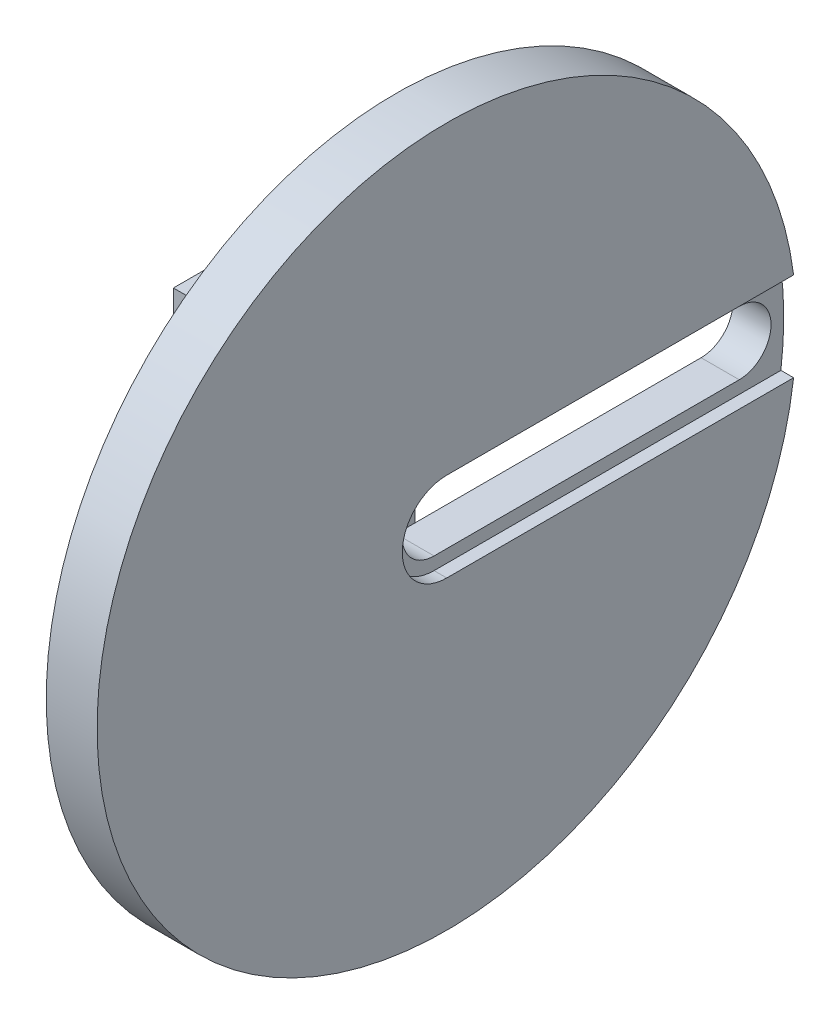
ISO-10303-21;
HEADER;
FILE_DESCRIPTION(('STEP AP214'),'2;1');
FILE_NAME('part.step','',(''),(''),'','','');
FILE_SCHEMA(('AUTOMOTIVE_DESIGN { 1 0 10303 214 1 1 1 1 }'));
ENDSEC;
DATA;
#1=APPLICATION_CONTEXT('core data for automotive mechanical design processes');
#2=APPLICATION_PROTOCOL_DEFINITION('international standard','automotive_design',2000,#1);
#3=PRODUCT_CONTEXT('',#1,'mechanical');
#4=PRODUCT('Part','Part','',(#3));
#5=PRODUCT_RELATED_PRODUCT_CATEGORY('part','',(#4));
#6=PRODUCT_DEFINITION_FORMATION('','',#4);
#7=PRODUCT_DEFINITION_CONTEXT('part definition',#1,'design');
#8=PRODUCT_DEFINITION('design','',#6,#7);
#9=PRODUCT_DEFINITION_SHAPE('','',#8);
#10=(LENGTH_UNIT() NAMED_UNIT(*) SI_UNIT(.MILLI.,.METRE.));
#11=(NAMED_UNIT(*) PLANE_ANGLE_UNIT() SI_UNIT($,.RADIAN.));
#12=(NAMED_UNIT(*) SI_UNIT($,.STERADIAN.) SOLID_ANGLE_UNIT());
#13=UNCERTAINTY_MEASURE_WITH_UNIT(LENGTH_MEASURE(1.E-05),#10,'distance_accuracy_value','');
#14=(GEOMETRIC_REPRESENTATION_CONTEXT(3) GLOBAL_UNCERTAINTY_ASSIGNED_CONTEXT((#13)) GLOBAL_UNIT_ASSIGNED_CONTEXT((#10,
#11,#12)) REPRESENTATION_CONTEXT('',''));
#15=CARTESIAN_POINT('',(0.,0.,0.));
#16=DIRECTION('',(0.,0.,1.));
#17=DIRECTION('',(1.,0.,0.));
#18=AXIS2_PLACEMENT_3D('',#15,#16,#17);
#19=CARTESIAN_POINT('',(-0.001000000000001,0.,0.));
#20=DIRECTION('',(1.,0.,0.));
#21=DIRECTION('',(0.,0.,-1.));
#22=AXIS2_PLACEMENT_3D('',#19,#20,#21);
#23=CYLINDRICAL_SURFACE('',#22,5.);
#24=CARTESIAN_POINT('',(36.,0.,0.));
#25=DIRECTION('',(1.,0.,0.));
#26=DIRECTION('',(0.,0.,-1.));
#27=AXIS2_PLACEMENT_3D('',#24,#25,#26);
#28=CIRCLE('',#27,5.);
#29=CARTESIAN_POINT('',(36.,-5.,0.));
#30=VERTEX_POINT('',#29);
#31=CARTESIAN_POINT('',(36.,5.,0.));
#32=VERTEX_POINT('',#31);
#33=EDGE_CURVE('E187',#30,#32,#28,.F.);
#34=ORIENTED_EDGE('',*,*,#33,.F.);
#35=DIRECTION('',(1.,0.,0.));
#36=VECTOR('',#35,1.);
#37=CARTESIAN_POINT('',(-0.001000000000001,-5.,0.));
#38=LINE('',#37,#36);
#39=CARTESIAN_POINT('',(30.,-5.,0.));
#40=VERTEX_POINT('',#39);
#41=EDGE_CURVE('E197',#40,#30,#38,.T.);
#42=ORIENTED_EDGE('',*,*,#41,.F.);
#43=CARTESIAN_POINT('',(30.,0.,0.));
#44=DIRECTION('',(1.,0.,0.));
#45=DIRECTION('',(0.,0.,-1.));
#46=AXIS2_PLACEMENT_3D('',#43,#44,#45);
#47=CIRCLE('',#46,5.);
#48=CARTESIAN_POINT('',(30.,5.,0.));
#49=VERTEX_POINT('',#48);
#50=EDGE_CURVE('E194',#40,#49,#47,.F.);
#51=ORIENTED_EDGE('',*,*,#50,.T.);
#52=DIRECTION('',(1.,0.,0.));
#53=VECTOR('',#52,1.);
#54=CARTESIAN_POINT('',(-0.001000000000001,5.,0.));
#55=LINE('',#54,#53);
#56=EDGE_CURVE('E198',#49,#32,#55,.T.);
#57=ORIENTED_EDGE('',*,*,#56,.T.);
#58=EDGE_LOOP('',(#34,#42,#51,#57));
#59=FACE_BOUND('',#58,.T.);
#60=ADVANCED_FACE('F33',(#59),#23,.F.);
#61=CARTESIAN_POINT('',(-0.001000000000001,5.,0.));
#62=DIRECTION('',(0.,-1.,0.));
#63=DIRECTION('',(0.,0.,-1.));
#64=AXIS2_PLACEMENT_3D('',#61,#62,#63);
#65=PLANE('',#64);
#66=DIRECTION('',(1.,0.,0.));
#67=VECTOR('',#66,1.);
#68=CARTESIAN_POINT('',(-0.001000000000001,5.,-48.));
#69=LINE('',#68,#67);
#70=CARTESIAN_POINT('',(30.,5.,-48.));
#71=VERTEX_POINT('',#70);
#72=CARTESIAN_POINT('',(36.,5.,-48.));
#73=VERTEX_POINT('',#72);
#74=EDGE_CURVE('E202',#71,#73,#69,.T.);
#75=ORIENTED_EDGE('',*,*,#74,.T.);
#76=DIRECTION('',(0.,0.,1.));
#77=VECTOR('',#76,1.);
#78=CARTESIAN_POINT('',(36.,5.,0.));
#79=LINE('',#78,#77);
#80=EDGE_CURVE('E184',#73,#32,#79,.T.);
#81=ORIENTED_EDGE('',*,*,#80,.T.);
#82=ORIENTED_EDGE('',*,*,#56,.F.);
#83=DIRECTION('',(0.,0.,1.));
#84=VECTOR('',#83,1.);
#85=CARTESIAN_POINT('',(30.,5.,0.));
#86=LINE('',#85,#84);
#87=EDGE_CURVE('E191',#71,#49,#86,.T.);
#88=ORIENTED_EDGE('',*,*,#87,.F.);
#89=EDGE_LOOP('',(#75,#81,#82,#88));
#90=FACE_BOUND('',#89,.T.);
#91=ADVANCED_FACE('F338',(#90),#65,.T.);
#92=CARTESIAN_POINT('',(-0.001000000000001,0.,-48.));
#93=DIRECTION('',(1.,0.,0.));
#94=DIRECTION('',(0.,0.,-1.));
#95=AXIS2_PLACEMENT_3D('',#92,#93,#94);
#96=CYLINDRICAL_SURFACE('',#95,5.);
#97=CARTESIAN_POINT('',(36.,0.,-48.));
#98=DIRECTION('',(1.,0.,0.));
#99=DIRECTION('',(0.,0.,-1.));
#100=AXIS2_PLACEMENT_3D('',#97,#98,#99);
#101=CIRCLE('',#100,5.);
#102=CARTESIAN_POINT('',(36.,-5.,-48.));
#103=VERTEX_POINT('',#102);
#104=EDGE_CURVE('E55',#73,#103,#101,.F.);
#105=ORIENTED_EDGE('',*,*,#104,.F.);
#106=ORIENTED_EDGE('',*,*,#74,.F.);
#107=CARTESIAN_POINT('',(30.,0.,-48.));
#108=DIRECTION('',(1.,0.,0.));
#109=DIRECTION('',(0.,0.,-1.));
#110=AXIS2_PLACEMENT_3D('',#107,#108,#109);
#111=CIRCLE('',#110,5.);
#112=CARTESIAN_POINT('',(30.,-5.,-48.));
#113=VERTEX_POINT('',#112);
#114=EDGE_CURVE('E189',#71,#113,#111,.F.);
#115=ORIENTED_EDGE('',*,*,#114,.T.);
#116=DIRECTION('',(1.,0.,0.));
#117=VECTOR('',#116,1.);
#118=CARTESIAN_POINT('',(-0.001000000000001,-5.,-48.));
#119=LINE('',#118,#117);
#120=EDGE_CURVE('E205',#113,#103,#119,.T.);
#121=ORIENTED_EDGE('',*,*,#120,.T.);
#122=EDGE_LOOP('',(#105,#106,#115,#121));
#123=FACE_BOUND('',#122,.T.);
#124=ADVANCED_FACE('F344',(#123),#96,.F.);
#125=CARTESIAN_POINT('',(-0.001000000000001,-5.,0.));
#126=DIRECTION('',(0.,-1.,0.));
#127=DIRECTION('',(0.,0.,-1.));
#128=AXIS2_PLACEMENT_3D('',#125,#126,#127);
#129=PLANE('',#128);
#130=DIRECTION('',(0.,0.,1.));
#131=VECTOR('',#130,1.);
#132=CARTESIAN_POINT('',(36.,-5.,0.));
#133=LINE('',#132,#131);
#134=EDGE_CURVE('E11',#103,#30,#133,.T.);
#135=ORIENTED_EDGE('',*,*,#134,.F.);
#136=ORIENTED_EDGE('',*,*,#120,.F.);
#137=DIRECTION('',(0.,0.,1.));
#138=VECTOR('',#137,1.);
#139=CARTESIAN_POINT('',(30.,-5.,0.));
#140=LINE('',#139,#138);
#141=EDGE_CURVE('E201',#113,#40,#140,.T.);
#142=ORIENTED_EDGE('',*,*,#141,.T.);
#143=ORIENTED_EDGE('',*,*,#41,.T.);
#144=EDGE_LOOP('',(#135,#136,#142,#143));
#145=FACE_BOUND('',#144,.T.);
#146=ADVANCED_FACE('F349',(#145),#129,.F.);
#147=CARTESIAN_POINT('',(18.,0.,0.));
#148=DIRECTION('',(-1.,0.,0.));
#149=DIRECTION('',(0.,0.,1.));
#150=AXIS2_PLACEMENT_3D('',#147,#148,#149);
#151=PLANE('',#150);
#152=CARTESIAN_POINT('',(18.,0.,0.));
#153=DIRECTION('',(-1.,0.,0.));
#154=DIRECTION('',(0.,0.,1.));
#155=AXIS2_PLACEMENT_3D('',#152,#153,#154);
#156=CIRCLE('',#155,9.);
#157=CARTESIAN_POINT('',(18.,0.,9.));
#158=VERTEX_POINT('',#157);
#159=EDGE_CURVE('E176',#158,#158,#156,.F.);
#160=ORIENTED_EDGE('',*,*,#159,.F.);
#161=EDGE_LOOP('',(#160));
#162=FACE_BOUND('',#161,.T.);
#163=DIRECTION('',(0.,0.,1.));
#164=VECTOR('',#163,1.);
#165=CARTESIAN_POINT('',(18.,-18.,15.));
#166=LINE('',#165,#164);
#167=CARTESIAN_POINT('',(18.,-18.,-15.));
#168=VERTEX_POINT('',#167);
#169=CARTESIAN_POINT('',(18.,-18.,15.));
#170=VERTEX_POINT('',#169);
#171=EDGE_CURVE('E216',#168,#170,#166,.T.);
#172=ORIENTED_EDGE('',*,*,#171,.F.);
#173=DIRECTION('',(0.,1.,0.));
#174=VECTOR('',#173,1.);
#175=CARTESIAN_POINT('',(18.,-26.,-15.));
#176=LINE('',#175,#174);
#177=CARTESIAN_POINT('',(18.,18.,-15.));
#178=VERTEX_POINT('',#177);
#179=EDGE_CURVE('E272',#168,#178,#176,.T.);
#180=ORIENTED_EDGE('',*,*,#179,.T.);
#181=DIRECTION('',(0.,0.,-1.));
#182=VECTOR('',#181,1.);
#183=CARTESIAN_POINT('',(18.,18.,15.));
#184=LINE('',#183,#182);
#185=CARTESIAN_POINT('',(18.,18.,15.));
#186=VERTEX_POINT('',#185);
#187=EDGE_CURVE('E239',#186,#178,#184,.T.);
#188=ORIENTED_EDGE('',*,*,#187,.F.);
#189=DIRECTION('',(0.,-1.,0.));
#190=VECTOR('',#189,1.);
#191=CARTESIAN_POINT('',(18.,-26.,15.));
#192=LINE('',#191,#190);
#193=EDGE_CURVE('E261',#186,#170,#192,.T.);
#194=ORIENTED_EDGE('',*,*,#193,.T.);
#195=EDGE_LOOP('',(#172,#180,#188,#194));
#196=FACE_BOUND('',#195,.T.);
#197=ADVANCED_FACE('F318',(#162,#196),#151,.F.);
#198=CARTESIAN_POINT('',(10.,0.,0.));
#199=DIRECTION('',(-1.,0.,0.));
#200=DIRECTION('',(0.,0.,1.));
#201=AXIS2_PLACEMENT_3D('',#198,#199,#200);
#202=PLANE('',#201);
#203=CARTESIAN_POINT('',(10.,0.,0.));
#204=DIRECTION('',(-1.,0.,0.));
#205=DIRECTION('',(0.,0.,1.));
#206=AXIS2_PLACEMENT_3D('',#203,#204,#205);
#207=CIRCLE('',#206,9.);
#208=CARTESIAN_POINT('',(10.,0.,9.));
#209=VERTEX_POINT('',#208);
#210=EDGE_CURVE('E170',#209,#209,#207,.F.);
#211=ORIENTED_EDGE('',*,*,#210,.T.);
#212=EDGE_LOOP('',(#211));
#213=FACE_BOUND('',#212,.T.);
#214=DIRECTION('',(0.,1.,0.));
#215=VECTOR('',#214,1.);
#216=CARTESIAN_POINT('',(10.,-26.,-15.));
#217=LINE('',#216,#215);
#218=CARTESIAN_POINT('',(10.,-26.,-15.));
#219=VERTEX_POINT('',#218);
#220=CARTESIAN_POINT('',(10.,26.,-15.));
#221=VERTEX_POINT('',#220);
#222=EDGE_CURVE('E270',#219,#221,#217,.T.);
#223=ORIENTED_EDGE('',*,*,#222,.F.);
#224=DIRECTION('',(0.,0.,-1.));
#225=VECTOR('',#224,1.);
#226=CARTESIAN_POINT('',(10.,-26.,15.));
#227=LINE('',#226,#225);
#228=CARTESIAN_POINT('',(10.,-26.,15.));
#229=VERTEX_POINT('',#228);
#230=EDGE_CURVE('E273',#229,#219,#227,.T.);
#231=ORIENTED_EDGE('',*,*,#230,.F.);
#232=DIRECTION('',(0.,-1.,0.));
#233=VECTOR('',#232,1.);
#234=CARTESIAN_POINT('',(10.,-26.,15.));
#235=LINE('',#234,#233);
#236=CARTESIAN_POINT('',(10.,26.,15.));
#237=VERTEX_POINT('',#236);
#238=EDGE_CURVE('E277',#237,#229,#235,.T.);
#239=ORIENTED_EDGE('',*,*,#238,.F.);
#240=DIRECTION('',(0.,0.,1.));
#241=VECTOR('',#240,1.);
#242=CARTESIAN_POINT('',(10.,26.,15.));
#243=LINE('',#242,#241);
#244=EDGE_CURVE('E283',#221,#237,#243,.T.);
#245=ORIENTED_EDGE('',*,*,#244,.F.);
#246=EDGE_LOOP('',(#223,#231,#239,#245));
#247=FACE_BOUND('',#246,.T.);
#248=ADVANCED_FACE('F303',(#213,#247),#202,.T.);
#249=CARTESIAN_POINT('',(18.,-26.,-15.));
#250=DIRECTION('',(0.,0.,1.));
#251=DIRECTION('',(1.,0.,0.));
#252=AXIS2_PLACEMENT_3D('',#249,#250,#251);
#253=PLANE('',#252);
#254=ORIENTED_EDGE('',*,*,#222,.T.);
#255=DIRECTION('',(-1.,0.,0.));
#256=VECTOR('',#255,1.);
#257=CARTESIAN_POINT('',(18.,26.,-15.));
#258=LINE('',#257,#256);
#259=CARTESIAN_POINT('',(30.,26.,-15.));
#260=VERTEX_POINT('',#259);
#261=EDGE_CURVE('E41',#260,#221,#258,.T.);
#262=ORIENTED_EDGE('',*,*,#261,.F.);
#263=DIRECTION('',(0.,1.,0.));
#264=VECTOR('',#263,1.);
#265=CARTESIAN_POINT('',(30.,26.,-15.));
#266=LINE('',#265,#264);
#267=CARTESIAN_POINT('',(30.,18.,-15.));
#268=VERTEX_POINT('',#267);
#269=EDGE_CURVE('E246',#268,#260,#266,.T.);
#270=ORIENTED_EDGE('',*,*,#269,.F.);
#271=DIRECTION('',(-1.,0.,0.));
#272=VECTOR('',#271,1.);
#273=CARTESIAN_POINT('',(30.,18.,-15.));
#274=LINE('',#273,#272);
#275=EDGE_CURVE('E252',#268,#178,#274,.T.);
#276=ORIENTED_EDGE('',*,*,#275,.T.);
#277=ORIENTED_EDGE('',*,*,#179,.F.);
#278=DIRECTION('',(-1.,0.,0.));
#279=VECTOR('',#278,1.);
#280=CARTESIAN_POINT('',(30.,-18.,-15.));
#281=LINE('',#280,#279);
#282=CARTESIAN_POINT('',(30.,-18.,-15.));
#283=VERTEX_POINT('',#282);
#284=EDGE_CURVE('E236',#283,#168,#281,.T.);
#285=ORIENTED_EDGE('',*,*,#284,.F.);
#286=DIRECTION('',(0.,1.,0.));
#287=VECTOR('',#286,1.);
#288=CARTESIAN_POINT('',(30.,-26.,-15.));
#289=LINE('',#288,#287);
#290=CARTESIAN_POINT('',(30.,-26.,-15.));
#291=VERTEX_POINT('',#290);
#292=EDGE_CURVE('E225',#291,#283,#289,.T.);
#293=ORIENTED_EDGE('',*,*,#292,.F.);
#294=DIRECTION('',(-1.,0.,0.));
#295=VECTOR('',#294,1.);
#296=CARTESIAN_POINT('',(18.,-26.,-15.));
#297=LINE('',#296,#295);
#298=EDGE_CURVE('E276',#291,#219,#297,.T.);
#299=ORIENTED_EDGE('',*,*,#298,.T.);
#300=EDGE_LOOP('',(#254,#262,#270,#276,#277,#285,#293,#299));
#301=FACE_BOUND('',#300,.T.);
#302=ADVANCED_FACE('F35',(#301),#253,.F.);
#303=CARTESIAN_POINT('',(18.,26.,15.));
#304=DIRECTION('',(0.,-1.,0.));
#305=DIRECTION('',(0.,0.,-1.));
#306=AXIS2_PLACEMENT_3D('',#303,#304,#305);
#307=PLANE('',#306);
#308=ORIENTED_EDGE('',*,*,#244,.T.);
#309=DIRECTION('',(-1.,0.,0.));
#310=VECTOR('',#309,1.);
#311=CARTESIAN_POINT('',(18.,26.,15.));
#312=LINE('',#311,#310);
#313=CARTESIAN_POINT('',(30.,26.,15.));
#314=VERTEX_POINT('',#313);
#315=EDGE_CURVE('E290',#314,#237,#312,.T.);
#316=ORIENTED_EDGE('',*,*,#315,.F.);
#317=DIRECTION('',(0.,0.,1.));
#318=VECTOR('',#317,1.);
#319=CARTESIAN_POINT('',(30.,26.,15.));
#320=LINE('',#319,#318);
#321=EDGE_CURVE('E249',#260,#314,#320,.T.);
#322=ORIENTED_EDGE('',*,*,#321,.F.);
#323=ORIENTED_EDGE('',*,*,#261,.T.);
#324=EDGE_LOOP('',(#308,#316,#322,#323));
#325=FACE_BOUND('',#324,.T.);
#326=ADVANCED_FACE('F296',(#325),#307,.F.);
#327=CARTESIAN_POINT('',(18.,-26.,15.));
#328=DIRECTION('',(0.,0.,-1.));
#329=DIRECTION('',(-1.,0.,0.));
#330=AXIS2_PLACEMENT_3D('',#327,#328,#329);
#331=PLANE('',#330);
#332=ORIENTED_EDGE('',*,*,#238,.T.);
#333=DIRECTION('',(-1.,0.,0.));
#334=VECTOR('',#333,1.);
#335=CARTESIAN_POINT('',(18.,-26.,15.));
#336=LINE('',#335,#334);
#337=CARTESIAN_POINT('',(30.,-26.,15.));
#338=VERTEX_POINT('',#337);
#339=EDGE_CURVE('E288',#338,#229,#336,.T.);
#340=ORIENTED_EDGE('',*,*,#339,.F.);
#341=DIRECTION('',(0.,-1.,0.));
#342=VECTOR('',#341,1.);
#343=CARTESIAN_POINT('',(30.,-26.,15.));
#344=LINE('',#343,#342);
#345=CARTESIAN_POINT('',(30.,-18.,15.));
#346=VERTEX_POINT('',#345);
#347=EDGE_CURVE('E219',#346,#338,#344,.T.);
#348=ORIENTED_EDGE('',*,*,#347,.F.);
#349=DIRECTION('',(-1.,0.,0.));
#350=VECTOR('',#349,1.);
#351=CARTESIAN_POINT('',(30.,-18.,15.));
#352=LINE('',#351,#350);
#353=EDGE_CURVE('E231',#346,#170,#352,.T.);
#354=ORIENTED_EDGE('',*,*,#353,.T.);
#355=ORIENTED_EDGE('',*,*,#193,.F.);
#356=DIRECTION('',(-1.,0.,0.));
#357=VECTOR('',#356,1.);
#358=CARTESIAN_POINT('',(30.,18.,15.));
#359=LINE('',#358,#357);
#360=CARTESIAN_POINT('',(30.,18.,15.));
#361=VERTEX_POINT('',#360);
#362=EDGE_CURVE('E265',#361,#186,#359,.T.);
#363=ORIENTED_EDGE('',*,*,#362,.F.);
#364=DIRECTION('',(0.,-1.,0.));
#365=VECTOR('',#364,1.);
#366=CARTESIAN_POINT('',(30.,26.,15.));
#367=LINE('',#366,#365);
#368=EDGE_CURVE('E240',#314,#361,#367,.T.);
#369=ORIENTED_EDGE('',*,*,#368,.F.);
#370=ORIENTED_EDGE('',*,*,#315,.T.);
#371=EDGE_LOOP('',(#332,#340,#348,#354,#355,#363,#369,#370));
#372=FACE_BOUND('',#371,.T.);
#373=ADVANCED_FACE('F306',(#372),#331,.F.);
#374=CARTESIAN_POINT('',(18.,-26.,15.));
#375=DIRECTION('',(0.,1.,0.));
#376=DIRECTION('',(0.,0.,1.));
#377=AXIS2_PLACEMENT_3D('',#374,#375,#376);
#378=PLANE('',#377);
#379=ORIENTED_EDGE('',*,*,#230,.T.);
#380=ORIENTED_EDGE('',*,*,#298,.F.);
#381=DIRECTION('',(0.,0.,-1.));
#382=VECTOR('',#381,1.);
#383=CARTESIAN_POINT('',(30.,-26.,15.));
#384=LINE('',#383,#382);
#385=EDGE_CURVE('E222',#338,#291,#384,.T.);
#386=ORIENTED_EDGE('',*,*,#385,.F.);
#387=ORIENTED_EDGE('',*,*,#339,.T.);
#388=EDGE_LOOP('',(#379,#380,#386,#387));
#389=FACE_BOUND('',#388,.T.);
#390=ADVANCED_FACE('F309',(#389),#378,.F.);
#391=CARTESIAN_POINT('',(30.,18.,15.));
#392=DIRECTION('',(0.,1.,0.));
#393=DIRECTION('',(0.,0.,1.));
#394=AXIS2_PLACEMENT_3D('',#391,#392,#393);
#395=PLANE('',#394);
#396=ORIENTED_EDGE('',*,*,#187,.T.);
#397=ORIENTED_EDGE('',*,*,#275,.F.);
#398=DIRECTION('',(0.,0.,-1.));
#399=VECTOR('',#398,1.);
#400=CARTESIAN_POINT('',(30.,18.,15.));
#401=LINE('',#400,#399);
#402=EDGE_CURVE('E243',#361,#268,#401,.T.);
#403=ORIENTED_EDGE('',*,*,#402,.F.);
#404=ORIENTED_EDGE('',*,*,#362,.T.);
#405=EDGE_LOOP('',(#396,#397,#403,#404));
#406=FACE_BOUND('',#405,.T.);
#407=ADVANCED_FACE('F321',(#406),#395,.F.);
#408=CARTESIAN_POINT('',(30.,-18.,15.));
#409=DIRECTION('',(0.,-1.,0.));
#410=DIRECTION('',(0.,0.,-1.));
#411=AXIS2_PLACEMENT_3D('',#408,#409,#410);
#412=PLANE('',#411);
#413=ORIENTED_EDGE('',*,*,#171,.T.);
#414=ORIENTED_EDGE('',*,*,#353,.F.);
#415=DIRECTION('',(0.,0.,1.));
#416=VECTOR('',#415,1.);
#417=CARTESIAN_POINT('',(30.,-18.,15.));
#418=LINE('',#417,#416);
#419=EDGE_CURVE('E228',#283,#346,#418,.T.);
#420=ORIENTED_EDGE('',*,*,#419,.F.);
#421=ORIENTED_EDGE('',*,*,#284,.T.);
#422=EDGE_LOOP('',(#413,#414,#420,#421));
#423=FACE_BOUND('',#422,.T.);
#424=ADVANCED_FACE('F317',(#423),#412,.F.);
#425=CARTESIAN_POINT('',(30.,0.,0.));
#426=DIRECTION('',(1.,0.,0.));
#427=DIRECTION('',(0.,0.,-1.));
#428=AXIS2_PLACEMENT_3D('',#425,#426,#427);
#429=PLANE('',#428);
#430=ORIENTED_EDGE('',*,*,#87,.T.);
#431=ORIENTED_EDGE('',*,*,#50,.F.);
#432=ORIENTED_EDGE('',*,*,#141,.F.);
#433=ORIENTED_EDGE('',*,*,#114,.F.);
#434=EDGE_LOOP('',(#430,#431,#432,#433));
#435=FACE_BOUND('',#434,.T.);
#436=ORIENTED_EDGE('',*,*,#347,.T.);
#437=ORIENTED_EDGE('',*,*,#385,.T.);
#438=ORIENTED_EDGE('',*,*,#292,.T.);
#439=ORIENTED_EDGE('',*,*,#419,.T.);
#440=EDGE_LOOP('',(#436,#437,#438,#439));
#441=FACE_BOUND('',#440,.T.);
#442=CARTESIAN_POINT('',(30.,0.,0.));
#443=DIRECTION('',(1.,0.,0.));
#444=DIRECTION('',(0.,0.,-1.));
#445=AXIS2_PLACEMENT_3D('',#442,#443,#444);
#446=CIRCLE('',#445,55.);
#447=CARTESIAN_POINT('',(30.,0.,-55.));
#448=VERTEX_POINT('',#447);
#449=EDGE_CURVE('E212',#448,#448,#446,.T.);
#450=ORIENTED_EDGE('',*,*,#449,.F.);
#451=EDGE_LOOP('',(#450));
#452=FACE_BOUND('',#451,.T.);
#453=ORIENTED_EDGE('',*,*,#402,.T.);
#454=ORIENTED_EDGE('',*,*,#269,.T.);
#455=ORIENTED_EDGE('',*,*,#321,.T.);
#456=ORIENTED_EDGE('',*,*,#368,.T.);
#457=EDGE_LOOP('',(#453,#454,#455,#456));
#458=FACE_BOUND('',#457,.T.);
#459=ADVANCED_FACE('F311',(#435,#441,#452,#458),#429,.F.);
#460=CARTESIAN_POINT('',(38.,0.,0.));
#461=DIRECTION('',(-1.,0.,0.));
#462=DIRECTION('',(0.,0.,1.));
#463=AXIS2_PLACEMENT_3D('',#460,#461,#462);
#464=CYLINDRICAL_SURFACE('',#463,55.);
#465=CARTESIAN_POINT('',(38.,0.,0.));
#466=DIRECTION('',(1.,0.,0.));
#467=DIRECTION('',(0.,0.,-1.));
#468=AXIS2_PLACEMENT_3D('',#465,#466,#467);
#469=CIRCLE('',#468,55.);
#470=CARTESIAN_POINT('',(38.,6.99999999999998,-54.5527267879434));
#471=VERTEX_POINT('',#470);
#472=CARTESIAN_POINT('',(38.,-7.,-54.5527267879434));
#473=VERTEX_POINT('',#472);
#474=EDGE_CURVE('E213',#471,#473,#469,.T.);
#475=ORIENTED_EDGE('',*,*,#474,.F.);
#476=DIRECTION('',(1.,0.,0.));
#477=VECTOR('',#476,1.);
#478=CARTESIAN_POINT('',(36.,6.99999999999998,-54.5527267879434));
#479=LINE('',#478,#477);
#480=CARTESIAN_POINT('',(36.,6.99999999999998,-54.5527267879434));
#481=VERTEX_POINT('',#480);
#482=EDGE_CURVE('E180',#481,#471,#479,.T.);
#483=ORIENTED_EDGE('',*,*,#482,.F.);
#484=CARTESIAN_POINT('',(36.,0.,0.));
#485=DIRECTION('',(1.,0.,0.));
#486=DIRECTION('',(0.,0.,-1.));
#487=AXIS2_PLACEMENT_3D('',#484,#485,#486);
#488=CIRCLE('',#487,55.);
#489=CARTESIAN_POINT('',(36.,-7.,-54.5527267879434));
#490=VERTEX_POINT('',#489);
#491=EDGE_CURVE('E160',#490,#481,#488,.T.);
#492=ORIENTED_EDGE('',*,*,#491,.F.);
#493=DIRECTION('',(1.,0.,0.));
#494=VECTOR('',#493,1.);
#495=CARTESIAN_POINT('',(36.,-7.,-54.5527267879434));
#496=LINE('',#495,#494);
#497=EDGE_CURVE('E151',#490,#473,#496,.T.);
#498=ORIENTED_EDGE('',*,*,#497,.T.);
#499=EDGE_LOOP('',(#475,#483,#492,#498));
#500=FACE_BOUND('',#499,.T.);
#501=ORIENTED_EDGE('',*,*,#449,.T.);
#502=EDGE_LOOP('',(#501));
#503=FACE_BOUND('',#502,.T.);
#504=ADVANCED_FACE('F325',(#500,#503),#464,.T.);
#505=CARTESIAN_POINT('',(38.,0.,0.));
#506=DIRECTION('',(1.,0.,0.));
#507=DIRECTION('',(0.,0.,-1.));
#508=AXIS2_PLACEMENT_3D('',#505,#506,#507);
#509=PLANE('',#508);
#510=DIRECTION('',(0.,0.,1.));
#511=VECTOR('',#510,1.);
#512=CARTESIAN_POINT('',(38.,7.,0.));
#513=LINE('',#512,#511);
#514=CARTESIAN_POINT('',(38.,7.,0.));
#515=VERTEX_POINT('',#514);
#516=EDGE_CURVE('E164',#471,#515,#513,.T.);
#517=ORIENTED_EDGE('',*,*,#516,.F.);
#518=ORIENTED_EDGE('',*,*,#474,.T.);
#519=DIRECTION('',(0.,0.,-1.));
#520=VECTOR('',#519,1.);
#521=CARTESIAN_POINT('',(38.,-7.,0.));
#522=LINE('',#521,#520);
#523=CARTESIAN_POINT('',(38.,-7.,0.));
#524=VERTEX_POINT('',#523);
#525=EDGE_CURVE('E167',#524,#473,#522,.T.);
#526=ORIENTED_EDGE('',*,*,#525,.F.);
#527=CARTESIAN_POINT('',(38.,0.,0.));
#528=DIRECTION('',(1.,0.,0.));
#529=DIRECTION('',(0.,0.,-1.));
#530=AXIS2_PLACEMENT_3D('',#527,#528,#529);
#531=CIRCLE('',#530,7.);
#532=EDGE_CURVE('E48',#515,#524,#531,.T.);
#533=ORIENTED_EDGE('',*,*,#532,.F.);
#534=EDGE_LOOP('',(#517,#518,#526,#533));
#535=FACE_BOUND('',#534,.T.);
#536=ADVANCED_FACE('F332',(#535),#509,.T.);
#537=CARTESIAN_POINT('',(36.,0.,0.));
#538=DIRECTION('',(1.,0.,0.));
#539=DIRECTION('',(0.,0.,-1.));
#540=AXIS2_PLACEMENT_3D('',#537,#538,#539);
#541=PLANE('',#540);
#542=CARTESIAN_POINT('',(36.,0.,0.));
#543=DIRECTION('',(1.,0.,0.));
#544=DIRECTION('',(0.,0.,-1.));
#545=AXIS2_PLACEMENT_3D('',#542,#543,#544);
#546=CIRCLE('',#545,7.);
#547=CARTESIAN_POINT('',(36.,7.,0.));
#548=VERTEX_POINT('',#547);
#549=CARTESIAN_POINT('',(36.,-7.,0.));
#550=VERTEX_POINT('',#549);
#551=EDGE_CURVE('E147',#548,#550,#546,.T.);
#552=ORIENTED_EDGE('',*,*,#551,.T.);
#553=DIRECTION('',(0.,0.,-1.));
#554=VECTOR('',#553,1.);
#555=CARTESIAN_POINT('',(36.,-7.,0.));
#556=LINE('',#555,#554);
#557=EDGE_CURVE('E155',#550,#490,#556,.T.);
#558=ORIENTED_EDGE('',*,*,#557,.T.);
#559=ORIENTED_EDGE('',*,*,#491,.T.);
#560=DIRECTION('',(0.,0.,1.));
#561=VECTOR('',#560,1.);
#562=CARTESIAN_POINT('',(36.,7.,0.));
#563=LINE('',#562,#561);
#564=EDGE_CURVE('E152',#481,#548,#563,.T.);
#565=ORIENTED_EDGE('',*,*,#564,.T.);
#566=EDGE_LOOP('',(#552,#558,#559,#565));
#567=FACE_BOUND('',#566,.T.);
#568=ORIENTED_EDGE('',*,*,#33,.T.);
#569=ORIENTED_EDGE('',*,*,#80,.F.);
#570=ORIENTED_EDGE('',*,*,#104,.T.);
#571=ORIENTED_EDGE('',*,*,#134,.T.);
#572=EDGE_LOOP('',(#568,#569,#570,#571));
#573=FACE_BOUND('',#572,.T.);
#574=ADVANCED_FACE('F162',(#567,#573),#541,.T.);
#575=CARTESIAN_POINT('',(36.,0.,0.));
#576=DIRECTION('',(1.,0.,0.));
#577=DIRECTION('',(0.,0.,-1.));
#578=AXIS2_PLACEMENT_3D('',#575,#576,#577);
#579=CYLINDRICAL_SURFACE('',#578,7.);
#580=ORIENTED_EDGE('',*,*,#532,.T.);
#581=DIRECTION('',(1.,0.,0.));
#582=VECTOR('',#581,1.);
#583=CARTESIAN_POINT('',(36.,-7.,0.));
#584=LINE('',#583,#582);
#585=EDGE_CURVE('E143',#550,#524,#584,.T.);
#586=ORIENTED_EDGE('',*,*,#585,.F.);
#587=ORIENTED_EDGE('',*,*,#551,.F.);
#588=DIRECTION('',(1.,0.,0.));
#589=VECTOR('',#588,1.);
#590=CARTESIAN_POINT('',(36.,7.,0.));
#591=LINE('',#590,#589);
#592=EDGE_CURVE('E178',#548,#515,#591,.T.);
#593=ORIENTED_EDGE('',*,*,#592,.T.);
#594=EDGE_LOOP('',(#580,#586,#587,#593));
#595=FACE_BOUND('',#594,.T.);
#596=ADVANCED_FACE('F145',(#595),#579,.F.);
#597=CARTESIAN_POINT('',(36.,7.,0.));
#598=DIRECTION('',(0.,1.,0.));
#599=DIRECTION('',(0.,0.,1.));
#600=AXIS2_PLACEMENT_3D('',#597,#598,#599);
#601=PLANE('',#600);
#602=ORIENTED_EDGE('',*,*,#516,.T.);
#603=ORIENTED_EDGE('',*,*,#592,.F.);
#604=ORIENTED_EDGE('',*,*,#564,.F.);
#605=ORIENTED_EDGE('',*,*,#482,.T.);
#606=EDGE_LOOP('',(#602,#603,#604,#605));
#607=FACE_BOUND('',#606,.T.);
#608=ADVANCED_FACE('F362',(#607),#601,.F.);
#609=CARTESIAN_POINT('',(36.,-7.,0.));
#610=DIRECTION('',(0.,-1.,0.));
#611=DIRECTION('',(0.,0.,-1.));
#612=AXIS2_PLACEMENT_3D('',#609,#610,#611);
#613=PLANE('',#612);
#614=ORIENTED_EDGE('',*,*,#525,.T.);
#615=ORIENTED_EDGE('',*,*,#497,.F.);
#616=ORIENTED_EDGE('',*,*,#557,.F.);
#617=ORIENTED_EDGE('',*,*,#585,.T.);
#618=EDGE_LOOP('',(#614,#615,#616,#617));
#619=FACE_BOUND('',#618,.T.);
#620=ADVANCED_FACE('F156',(#619),#613,.F.);
#621=CARTESIAN_POINT('',(38.001,0.,0.));
#622=DIRECTION('',(-1.,0.,0.));
#623=DIRECTION('',(0.,0.,1.));
#624=AXIS2_PLACEMENT_3D('',#621,#622,#623);
#625=CYLINDRICAL_SURFACE('',#624,9.);
#626=ORIENTED_EDGE('',*,*,#210,.F.);
#627=EDGE_LOOP('',(#626));
#628=FACE_BOUND('',#627,.T.);
#629=ORIENTED_EDGE('',*,*,#159,.T.);
#630=EDGE_LOOP('',(#629));
#631=FACE_BOUND('',#630,.T.);
#632=ADVANCED_FACE('F369',(#628,#631),#625,.F.);
#633=CLOSED_SHELL('',(#60,#91,#124,#146,#197,#248,#302,#326,#373,#390,#407,#424,#459,#504,#536,
#574,#596,#608,#620,#632));
#634=MANIFOLD_SOLID_BREP('B2',#633);
#635=ADVANCED_BREP_SHAPE_REPRESENTATION('',(#18,#634),#14);
#636=SHAPE_DEFINITION_REPRESENTATION(#9,#635);
ENDSEC;
END-ISO-10303-21;
